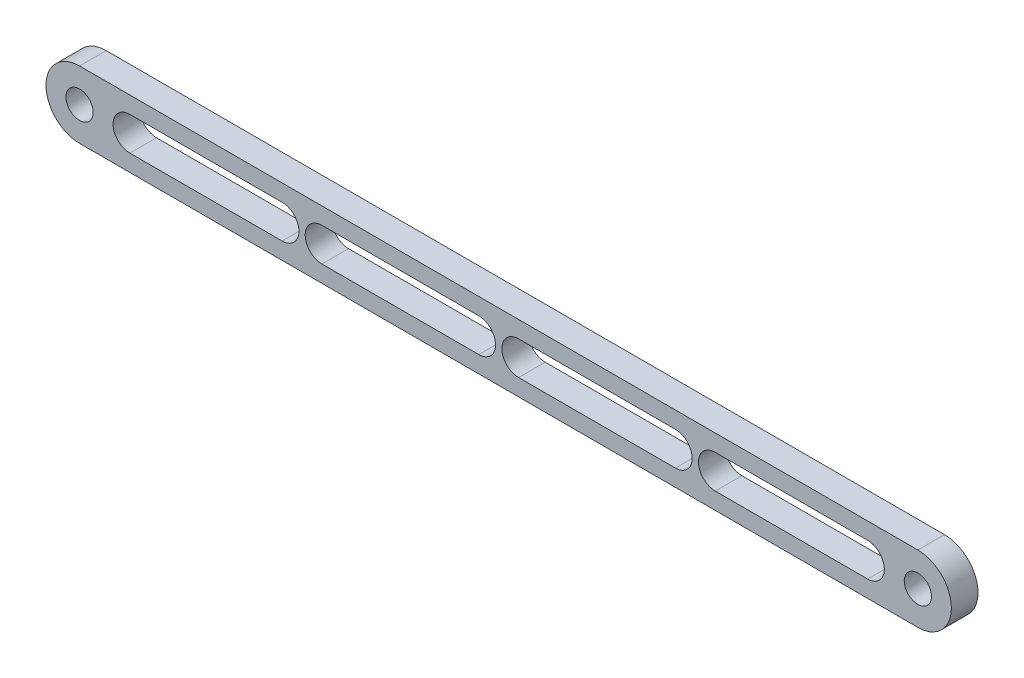
ISO-10303-21;
HEADER;
FILE_DESCRIPTION(('STEP AP214'),'2;1');
FILE_NAME('part.step','',(''),(''),'','','');
FILE_SCHEMA(('AUTOMOTIVE_DESIGN { 1 0 10303 214 1 1 1 1 }'));
ENDSEC;
DATA;
#1=APPLICATION_CONTEXT('core data for automotive mechanical design processes');
#2=APPLICATION_PROTOCOL_DEFINITION('international standard','automotive_design',2000,#1);
#3=PRODUCT_CONTEXT('',#1,'mechanical');
#4=PRODUCT('Part','Part','',(#3));
#5=PRODUCT_RELATED_PRODUCT_CATEGORY('part','',(#4));
#6=PRODUCT_DEFINITION_FORMATION('','',#4);
#7=PRODUCT_DEFINITION_CONTEXT('part definition',#1,'design');
#8=PRODUCT_DEFINITION('design','',#6,#7);
#9=PRODUCT_DEFINITION_SHAPE('','',#8);
#10=(LENGTH_UNIT() NAMED_UNIT(*) SI_UNIT(.MILLI.,.METRE.));
#11=(NAMED_UNIT(*) PLANE_ANGLE_UNIT() SI_UNIT($,.RADIAN.));
#12=(NAMED_UNIT(*) SI_UNIT($,.STERADIAN.) SOLID_ANGLE_UNIT());
#13=UNCERTAINTY_MEASURE_WITH_UNIT(LENGTH_MEASURE(1.E-05),#10,'distance_accuracy_value','');
#14=(GEOMETRIC_REPRESENTATION_CONTEXT(3) GLOBAL_UNCERTAINTY_ASSIGNED_CONTEXT((#13)) GLOBAL_UNIT_ASSIGNED_CONTEXT((#10,
#11,#12)) REPRESENTATION_CONTEXT('',''));
#15=CARTESIAN_POINT('',(0.,0.,0.));
#16=DIRECTION('',(0.,0.,1.));
#17=DIRECTION('',(1.,0.,0.));
#18=AXIS2_PLACEMENT_3D('',#15,#16,#17);
#19=CARTESIAN_POINT('',(200.,0.,0.));
#20=DIRECTION('',(0.,0.,1.));
#21=DIRECTION('',(1.,0.,0.));
#22=AXIS2_PLACEMENT_3D('',#19,#20,#21);
#23=CYLINDRICAL_SURFACE('',#22,8.);
#24=CARTESIAN_POINT('',(200.,0.,6.35));
#25=DIRECTION('',(0.,0.,1.));
#26=DIRECTION('',(1.,0.,0.));
#27=AXIS2_PLACEMENT_3D('',#24,#25,#26);
#28=CIRCLE('',#27,8.);
#29=CARTESIAN_POINT('',(200.,-8.,6.35));
#30=VERTEX_POINT('',#29);
#31=CARTESIAN_POINT('',(200.,8.,6.35));
#32=VERTEX_POINT('',#31);
#33=EDGE_CURVE('E312',#30,#32,#28,.T.);
#34=ORIENTED_EDGE('',*,*,#33,.F.);
#35=DIRECTION('',(0.,0.,1.));
#36=VECTOR('',#35,1.);
#37=CARTESIAN_POINT('',(200.,-8.,0.));
#38=LINE('',#37,#36);
#39=CARTESIAN_POINT('',(200.,-8.,0.));
#40=VERTEX_POINT('',#39);
#41=EDGE_CURVE('E11',#40,#30,#38,.T.);
#42=ORIENTED_EDGE('',*,*,#41,.F.);
#43=CARTESIAN_POINT('',(200.,0.,0.));
#44=DIRECTION('',(0.,0.,1.));
#45=DIRECTION('',(1.,0.,0.));
#46=AXIS2_PLACEMENT_3D('',#43,#44,#45);
#47=CIRCLE('',#46,8.);
#48=CARTESIAN_POINT('',(200.,8.,0.));
#49=VERTEX_POINT('',#48);
#50=EDGE_CURVE('E315',#40,#49,#47,.T.);
#51=ORIENTED_EDGE('',*,*,#50,.T.);
#52=DIRECTION('',(0.,0.,1.));
#53=VECTOR('',#52,1.);
#54=CARTESIAN_POINT('',(200.,8.,0.));
#55=LINE('',#54,#53);
#56=EDGE_CURVE('E36',#49,#32,#55,.T.);
#57=ORIENTED_EDGE('',*,*,#56,.T.);
#58=EDGE_LOOP('',(#34,#42,#51,#57));
#59=FACE_BOUND('',#58,.T.);
#60=ADVANCED_FACE('F33',(#59),#23,.T.);
#61=CARTESIAN_POINT('',(0.,-8.,0.));
#62=DIRECTION('',(0.,-1.,0.));
#63=DIRECTION('',(0.,0.,-1.));
#64=AXIS2_PLACEMENT_3D('',#61,#62,#63);
#65=PLANE('',#64);
#66=DIRECTION('',(1.,0.,0.));
#67=VECTOR('',#66,1.);
#68=CARTESIAN_POINT('',(0.,-8.,6.35));
#69=LINE('',#68,#67);
#70=CARTESIAN_POINT('',(0.,-8.,6.35));
#71=VERTEX_POINT('',#70);
#72=EDGE_CURVE('E319',#71,#30,#69,.T.);
#73=ORIENTED_EDGE('',*,*,#72,.F.);
#74=DIRECTION('',(0.,0.,1.));
#75=VECTOR('',#74,1.);
#76=CARTESIAN_POINT('',(0.,-8.,0.));
#77=LINE('',#76,#75);
#78=CARTESIAN_POINT('',(0.,-8.,0.));
#79=VERTEX_POINT('',#78);
#80=EDGE_CURVE('E41',#79,#71,#77,.T.);
#81=ORIENTED_EDGE('',*,*,#80,.F.);
#82=DIRECTION('',(1.,0.,0.));
#83=VECTOR('',#82,1.);
#84=CARTESIAN_POINT('',(0.,-8.,0.));
#85=LINE('',#84,#83);
#86=EDGE_CURVE('E325',#79,#40,#85,.T.);
#87=ORIENTED_EDGE('',*,*,#86,.T.);
#88=ORIENTED_EDGE('',*,*,#41,.T.);
#89=EDGE_LOOP('',(#73,#81,#87,#88));
#90=FACE_BOUND('',#89,.T.);
#91=ADVANCED_FACE('F351',(#90),#65,.T.);
#92=CARTESIAN_POINT('',(0.,0.,0.));
#93=DIRECTION('',(0.,0.,1.));
#94=DIRECTION('',(1.,0.,0.));
#95=AXIS2_PLACEMENT_3D('',#92,#93,#94);
#96=CYLINDRICAL_SURFACE('',#95,8.);
#97=CARTESIAN_POINT('',(0.,0.,6.35));
#98=DIRECTION('',(0.,0.,1.));
#99=DIRECTION('',(1.,0.,0.));
#100=AXIS2_PLACEMENT_3D('',#97,#98,#99);
#101=CIRCLE('',#100,8.);
#102=CARTESIAN_POINT('',(0.,8.,6.35));
#103=VERTEX_POINT('',#102);
#104=EDGE_CURVE('E333',#103,#71,#101,.T.);
#105=ORIENTED_EDGE('',*,*,#104,.F.);
#106=DIRECTION('',(0.,0.,1.));
#107=VECTOR('',#106,1.);
#108=CARTESIAN_POINT('',(0.,8.,0.));
#109=LINE('',#108,#107);
#110=CARTESIAN_POINT('',(0.,8.,0.));
#111=VERTEX_POINT('',#110);
#112=EDGE_CURVE('E338',#111,#103,#109,.T.);
#113=ORIENTED_EDGE('',*,*,#112,.F.);
#114=CARTESIAN_POINT('',(0.,0.,0.));
#115=DIRECTION('',(0.,0.,1.));
#116=DIRECTION('',(1.,0.,0.));
#117=AXIS2_PLACEMENT_3D('',#114,#115,#116);
#118=CIRCLE('',#117,8.);
#119=EDGE_CURVE('E322',#111,#79,#118,.T.);
#120=ORIENTED_EDGE('',*,*,#119,.T.);
#121=ORIENTED_EDGE('',*,*,#80,.T.);
#122=EDGE_LOOP('',(#105,#113,#120,#121));
#123=FACE_BOUND('',#122,.T.);
#124=ADVANCED_FACE('F356',(#123),#96,.T.);
#125=CARTESIAN_POINT('',(200.,8.,0.));
#126=DIRECTION('',(0.,1.,0.));
#127=DIRECTION('',(0.,0.,1.));
#128=AXIS2_PLACEMENT_3D('',#125,#126,#127);
#129=PLANE('',#128);
#130=DIRECTION('',(-1.,0.,0.));
#131=VECTOR('',#130,1.);
#132=CARTESIAN_POINT('',(200.,8.,6.35));
#133=LINE('',#132,#131);
#134=EDGE_CURVE('E330',#32,#103,#133,.T.);
#135=ORIENTED_EDGE('',*,*,#134,.F.);
#136=ORIENTED_EDGE('',*,*,#56,.F.);
#137=DIRECTION('',(-1.,0.,0.));
#138=VECTOR('',#137,1.);
#139=CARTESIAN_POINT('',(200.,8.,0.));
#140=LINE('',#139,#138);
#141=EDGE_CURVE('E318',#49,#111,#140,.T.);
#142=ORIENTED_EDGE('',*,*,#141,.T.);
#143=ORIENTED_EDGE('',*,*,#112,.T.);
#144=EDGE_LOOP('',(#135,#136,#142,#143));
#145=FACE_BOUND('',#144,.T.);
#146=ADVANCED_FACE('F346',(#145),#129,.T.);
#147=CARTESIAN_POINT('',(200.,0.,0.));
#148=DIRECTION('',(0.,0.,1.));
#149=DIRECTION('',(1.,0.,0.));
#150=AXIS2_PLACEMENT_3D('',#147,#148,#149);
#151=PLANE('',#150);
#152=DIRECTION('',(1.,0.,0.));
#153=VECTOR('',#152,1.);
#154=CARTESIAN_POINT('',(188.,-4.,0.));
#155=LINE('',#154,#153);
#156=CARTESIAN_POINT('',(151.660898385,-3.99999999999999,0.));
#157=VERTEX_POINT('',#156);
#158=CARTESIAN_POINT('',(188.,-4.,0.));
#159=VERTEX_POINT('',#158);
#160=EDGE_CURVE('E178',#157,#159,#155,.T.);
#161=ORIENTED_EDGE('',*,*,#160,.T.);
#162=CARTESIAN_POINT('',(188.,0.,0.));
#163=DIRECTION('',(0.,0.,1.));
#164=DIRECTION('',(-1.,0.,0.));
#165=AXIS2_PLACEMENT_3D('',#162,#163,#164);
#166=CIRCLE('',#165,4.);
#167=CARTESIAN_POINT('',(188.,4.,0.));
#168=VERTEX_POINT('',#167);
#169=EDGE_CURVE('E172',#159,#168,#166,.T.);
#170=ORIENTED_EDGE('',*,*,#169,.T.);
#171=DIRECTION('',(-1.,0.,0.));
#172=VECTOR('',#171,1.);
#173=CARTESIAN_POINT('',(151.660898385,4.,0.));
#174=LINE('',#173,#172);
#175=CARTESIAN_POINT('',(151.660898385,4.,0.));
#176=VERTEX_POINT('',#175);
#177=EDGE_CURVE('E181',#168,#176,#174,.T.);
#178=ORIENTED_EDGE('',*,*,#177,.T.);
#179=CARTESIAN_POINT('',(151.660898385,0.,0.));
#180=DIRECTION('',(0.,0.,1.));
#181=DIRECTION('',(-1.,0.,0.));
#182=AXIS2_PLACEMENT_3D('',#179,#180,#181);
#183=CIRCLE('',#182,3.99999999999999);
#184=EDGE_CURVE('E49',#176,#157,#183,.T.);
#185=ORIENTED_EDGE('',*,*,#184,.T.);
#186=EDGE_LOOP('',(#161,#170,#178,#185));
#187=FACE_BOUND('',#186,.T.);
#188=DIRECTION('',(-1.,0.,0.));
#189=VECTOR('',#188,1.);
#190=CARTESIAN_POINT('',(57.839101615,4.,0.));
#191=LINE('',#190,#189);
#192=CARTESIAN_POINT('',(95.25,4.,0.));
#193=VERTEX_POINT('',#192);
#194=CARTESIAN_POINT('',(57.839101615,4.,0.));
#195=VERTEX_POINT('',#194);
#196=EDGE_CURVE('E217',#193,#195,#191,.T.);
#197=ORIENTED_EDGE('',*,*,#196,.T.);
#198=CARTESIAN_POINT('',(57.839101615,0.,0.));
#199=DIRECTION('',(0.,0.,1.));
#200=DIRECTION('',(-1.,0.,0.));
#201=AXIS2_PLACEMENT_3D('',#198,#199,#200);
#202=CIRCLE('',#201,4.);
#203=CARTESIAN_POINT('',(57.839101615,-4.,0.));
#204=VERTEX_POINT('',#203);
#205=EDGE_CURVE('E207',#195,#204,#202,.T.);
#206=ORIENTED_EDGE('',*,*,#205,.T.);
#207=DIRECTION('',(1.,0.,0.));
#208=VECTOR('',#207,1.);
#209=CARTESIAN_POINT('',(95.25,-4.,0.));
#210=LINE('',#209,#208);
#211=CARTESIAN_POINT('',(95.25,-4.,0.));
#212=VERTEX_POINT('',#211);
#213=EDGE_CURVE('E210',#204,#212,#210,.T.);
#214=ORIENTED_EDGE('',*,*,#213,.T.);
#215=CARTESIAN_POINT('',(95.25,0.,0.));
#216=DIRECTION('',(0.,0.,1.));
#217=DIRECTION('',(-1.,0.,0.));
#218=AXIS2_PLACEMENT_3D('',#215,#216,#217);
#219=CIRCLE('',#218,4.);
#220=EDGE_CURVE('E214',#212,#193,#219,.T.);
#221=ORIENTED_EDGE('',*,*,#220,.T.);
#222=EDGE_LOOP('',(#197,#206,#214,#221));
#223=FACE_BOUND('',#222,.T.);
#224=DIRECTION('',(-1.,0.,0.));
#225=VECTOR('',#224,1.);
#226=CARTESIAN_POINT('',(12.,4.,0.));
#227=LINE('',#226,#225);
#228=CARTESIAN_POINT('',(48.339101615,4.,0.));
#229=VERTEX_POINT('',#228);
#230=CARTESIAN_POINT('',(12.,4.,0.));
#231=VERTEX_POINT('',#230);
#232=EDGE_CURVE('E249',#229,#231,#227,.T.);
#233=ORIENTED_EDGE('',*,*,#232,.T.);
#234=CARTESIAN_POINT('',(12.,0.,0.));
#235=DIRECTION('',(0.,0.,1.));
#236=DIRECTION('',(-1.,0.,0.));
#237=AXIS2_PLACEMENT_3D('',#234,#235,#236);
#238=CIRCLE('',#237,4.);
#239=CARTESIAN_POINT('',(12.,-4.,0.));
#240=VERTEX_POINT('',#239);
#241=EDGE_CURVE('E239',#231,#240,#238,.T.);
#242=ORIENTED_EDGE('',*,*,#241,.T.);
#243=DIRECTION('',(1.,0.,0.));
#244=VECTOR('',#243,1.);
#245=CARTESIAN_POINT('',(48.339101615,-3.99999999999999,0.));
#246=LINE('',#245,#244);
#247=CARTESIAN_POINT('',(48.339101615,-3.99999999999999,0.));
#248=VERTEX_POINT('',#247);
#249=EDGE_CURVE('E242',#240,#248,#246,.T.);
#250=ORIENTED_EDGE('',*,*,#249,.T.);
#251=CARTESIAN_POINT('',(48.339101615,0.,0.));
#252=DIRECTION('',(0.,0.,1.));
#253=DIRECTION('',(-1.,0.,0.));
#254=AXIS2_PLACEMENT_3D('',#251,#252,#253);
#255=CIRCLE('',#254,4.);
#256=EDGE_CURVE('E246',#248,#229,#255,.T.);
#257=ORIENTED_EDGE('',*,*,#256,.T.);
#258=EDGE_LOOP('',(#233,#242,#250,#257));
#259=FACE_BOUND('',#258,.T.);
#260=DIRECTION('',(-1.,0.,0.));
#261=VECTOR('',#260,1.);
#262=CARTESIAN_POINT('',(104.75,4.,0.));
#263=LINE('',#262,#261);
#264=CARTESIAN_POINT('',(142.160898385,4.,0.));
#265=VERTEX_POINT('',#264);
#266=CARTESIAN_POINT('',(104.75,4.,0.));
#267=VERTEX_POINT('',#266);
#268=EDGE_CURVE('E281',#265,#267,#263,.T.);
#269=ORIENTED_EDGE('',*,*,#268,.T.);
#270=CARTESIAN_POINT('',(104.75,0.,0.));
#271=DIRECTION('',(0.,0.,1.));
#272=DIRECTION('',(-1.,0.,0.));
#273=AXIS2_PLACEMENT_3D('',#270,#271,#272);
#274=CIRCLE('',#273,3.99999999999999);
#275=CARTESIAN_POINT('',(104.75,-3.99999999999999,0.));
#276=VERTEX_POINT('',#275);
#277=EDGE_CURVE('E271',#267,#276,#274,.T.);
#278=ORIENTED_EDGE('',*,*,#277,.T.);
#279=DIRECTION('',(1.,0.,0.));
#280=VECTOR('',#279,1.);
#281=CARTESIAN_POINT('',(142.160898385,-3.99999999999998,0.));
#282=LINE('',#281,#280);
#283=CARTESIAN_POINT('',(142.160898385,-3.99999999999998,0.));
#284=VERTEX_POINT('',#283);
#285=EDGE_CURVE('E274',#276,#284,#282,.T.);
#286=ORIENTED_EDGE('',*,*,#285,.T.);
#287=CARTESIAN_POINT('',(142.160898385,0.,0.));
#288=DIRECTION('',(0.,0.,1.));
#289=DIRECTION('',(-1.,0.,0.));
#290=AXIS2_PLACEMENT_3D('',#287,#288,#289);
#291=CIRCLE('',#290,3.99999999999999);
#292=EDGE_CURVE('E278',#284,#265,#291,.T.);
#293=ORIENTED_EDGE('',*,*,#292,.T.);
#294=EDGE_LOOP('',(#269,#278,#286,#293));
#295=FACE_BOUND('',#294,.T.);
#296=CARTESIAN_POINT('',(0.,0.,0.));
#297=DIRECTION('',(0.,0.,1.));
#298=DIRECTION('',(-1.,0.,0.));
#299=AXIS2_PLACEMENT_3D('',#296,#297,#298);
#300=CIRCLE('',#299,3.25);
#301=CARTESIAN_POINT('',(-3.25,0.,0.));
#302=VERTEX_POINT('',#301);
#303=EDGE_CURVE('E303',#302,#302,#300,.T.);
#304=ORIENTED_EDGE('',*,*,#303,.T.);
#305=EDGE_LOOP('',(#304));
#306=FACE_BOUND('',#305,.T.);
#307=CARTESIAN_POINT('',(200.,0.,0.));
#308=DIRECTION('',(0.,0.,1.));
#309=DIRECTION('',(-1.,0.,0.));
#310=AXIS2_PLACEMENT_3D('',#307,#308,#309);
#311=CIRCLE('',#310,3.25);
#312=CARTESIAN_POINT('',(196.75,0.,0.));
#313=VERTEX_POINT('',#312);
#314=EDGE_CURVE('E309',#313,#313,#311,.T.);
#315=ORIENTED_EDGE('',*,*,#314,.T.);
#316=EDGE_LOOP('',(#315));
#317=FACE_BOUND('',#316,.T.);
#318=ORIENTED_EDGE('',*,*,#50,.F.);
#319=ORIENTED_EDGE('',*,*,#86,.F.);
#320=ORIENTED_EDGE('',*,*,#119,.F.);
#321=ORIENTED_EDGE('',*,*,#141,.F.);
#322=EDGE_LOOP('',(#318,#319,#320,#321));
#323=FACE_BOUND('',#322,.T.);
#324=ADVANCED_FACE('F185',(#187,#223,#259,#295,#306,#317,#323),#151,.F.);
#325=CARTESIAN_POINT('',(200.,0.,6.35));
#326=DIRECTION('',(0.,0.,1.));
#327=DIRECTION('',(1.,0.,0.));
#328=AXIS2_PLACEMENT_3D('',#325,#326,#327);
#329=PLANE('',#328);
#330=CARTESIAN_POINT('',(188.,0.,6.35));
#331=DIRECTION('',(0.,0.,1.));
#332=DIRECTION('',(-1.,0.,0.));
#333=AXIS2_PLACEMENT_3D('',#330,#331,#332);
#334=CIRCLE('',#333,4.);
#335=CARTESIAN_POINT('',(188.,-4.,6.35));
#336=VERTEX_POINT('',#335);
#337=CARTESIAN_POINT('',(188.,4.,6.35));
#338=VERTEX_POINT('',#337);
#339=EDGE_CURVE('E57',#336,#338,#334,.T.);
#340=ORIENTED_EDGE('',*,*,#339,.F.);
#341=DIRECTION('',(1.,0.,0.));
#342=VECTOR('',#341,1.);
#343=CARTESIAN_POINT('',(188.,-4.,6.35));
#344=LINE('',#343,#342);
#345=CARTESIAN_POINT('',(151.660898385,-3.99999999999999,6.35));
#346=VERTEX_POINT('',#345);
#347=EDGE_CURVE('E188',#346,#336,#344,.T.);
#348=ORIENTED_EDGE('',*,*,#347,.F.);
#349=CARTESIAN_POINT('',(151.660898385,0.,6.35));
#350=DIRECTION('',(0.,0.,1.));
#351=DIRECTION('',(-1.,0.,0.));
#352=AXIS2_PLACEMENT_3D('',#349,#350,#351);
#353=CIRCLE('',#352,3.99999999999999);
#354=CARTESIAN_POINT('',(151.660898385,4.,6.35));
#355=VERTEX_POINT('',#354);
#356=EDGE_CURVE('E191',#355,#346,#353,.T.);
#357=ORIENTED_EDGE('',*,*,#356,.F.);
#358=DIRECTION('',(-1.,0.,0.));
#359=VECTOR('',#358,1.);
#360=CARTESIAN_POINT('',(151.660898385,4.,6.35));
#361=LINE('',#360,#359);
#362=EDGE_CURVE('E197',#338,#355,#361,.T.);
#363=ORIENTED_EDGE('',*,*,#362,.F.);
#364=EDGE_LOOP('',(#340,#348,#357,#363));
#365=FACE_BOUND('',#364,.T.);
#366=CARTESIAN_POINT('',(57.839101615,0.,6.35));
#367=DIRECTION('',(0.,0.,1.));
#368=DIRECTION('',(-1.,0.,0.));
#369=AXIS2_PLACEMENT_3D('',#366,#367,#368);
#370=CIRCLE('',#369,4.);
#371=CARTESIAN_POINT('',(57.839101615,4.,6.35));
#372=VERTEX_POINT('',#371);
#373=CARTESIAN_POINT('',(57.839101615,-4.,6.35));
#374=VERTEX_POINT('',#373);
#375=EDGE_CURVE('E203',#372,#374,#370,.T.);
#376=ORIENTED_EDGE('',*,*,#375,.F.);
#377=DIRECTION('',(-1.,0.,0.));
#378=VECTOR('',#377,1.);
#379=CARTESIAN_POINT('',(57.839101615,4.,6.35));
#380=LINE('',#379,#378);
#381=CARTESIAN_POINT('',(95.25,4.,6.35));
#382=VERTEX_POINT('',#381);
#383=EDGE_CURVE('E211',#382,#372,#380,.T.);
#384=ORIENTED_EDGE('',*,*,#383,.F.);
#385=CARTESIAN_POINT('',(95.25,0.,6.35));
#386=DIRECTION('',(0.,0.,1.));
#387=DIRECTION('',(-1.,0.,0.));
#388=AXIS2_PLACEMENT_3D('',#385,#386,#387);
#389=CIRCLE('',#388,4.);
#390=CARTESIAN_POINT('',(95.25,-4.,6.35));
#391=VERTEX_POINT('',#390);
#392=EDGE_CURVE('E225',#391,#382,#389,.T.);
#393=ORIENTED_EDGE('',*,*,#392,.F.);
#394=DIRECTION('',(1.,0.,0.));
#395=VECTOR('',#394,1.);
#396=CARTESIAN_POINT('',(95.25,-4.,6.35));
#397=LINE('',#396,#395);
#398=EDGE_CURVE('E222',#374,#391,#397,.T.);
#399=ORIENTED_EDGE('',*,*,#398,.F.);
#400=EDGE_LOOP('',(#376,#384,#393,#399));
#401=FACE_BOUND('',#400,.T.);
#402=CARTESIAN_POINT('',(12.,0.,6.35));
#403=DIRECTION('',(0.,0.,1.));
#404=DIRECTION('',(-1.,0.,0.));
#405=AXIS2_PLACEMENT_3D('',#402,#403,#404);
#406=CIRCLE('',#405,4.);
#407=CARTESIAN_POINT('',(12.,4.,6.35));
#408=VERTEX_POINT('',#407);
#409=CARTESIAN_POINT('',(12.,-4.,6.35));
#410=VERTEX_POINT('',#409);
#411=EDGE_CURVE('E232',#408,#410,#406,.T.);
#412=ORIENTED_EDGE('',*,*,#411,.F.);
#413=DIRECTION('',(-1.,0.,0.));
#414=VECTOR('',#413,1.);
#415=CARTESIAN_POINT('',(12.,4.,6.35));
#416=LINE('',#415,#414);
#417=CARTESIAN_POINT('',(48.339101615,4.,6.35));
#418=VERTEX_POINT('',#417);
#419=EDGE_CURVE('E243',#418,#408,#416,.T.);
#420=ORIENTED_EDGE('',*,*,#419,.F.);
#421=CARTESIAN_POINT('',(48.339101615,0.,6.35));
#422=DIRECTION('',(0.,0.,1.));
#423=DIRECTION('',(-1.,0.,0.));
#424=AXIS2_PLACEMENT_3D('',#421,#422,#423);
#425=CIRCLE('',#424,4.);
#426=CARTESIAN_POINT('',(48.339101615,-4.,6.35));
#427=VERTEX_POINT('',#426);
#428=EDGE_CURVE('E257',#427,#418,#425,.T.);
#429=ORIENTED_EDGE('',*,*,#428,.F.);
#430=DIRECTION('',(1.,0.,0.));
#431=VECTOR('',#430,1.);
#432=CARTESIAN_POINT('',(48.339101615,-3.99999999999999,6.35));
#433=LINE('',#432,#431);
#434=EDGE_CURVE('E254',#410,#427,#433,.T.);
#435=ORIENTED_EDGE('',*,*,#434,.F.);
#436=EDGE_LOOP('',(#412,#420,#429,#435));
#437=FACE_BOUND('',#436,.T.);
#438=CARTESIAN_POINT('',(104.75,0.,6.35));
#439=DIRECTION('',(0.,0.,1.));
#440=DIRECTION('',(-1.,0.,0.));
#441=AXIS2_PLACEMENT_3D('',#438,#439,#440);
#442=CIRCLE('',#441,3.99999999999999);
#443=CARTESIAN_POINT('',(104.75,4.,6.35));
#444=VERTEX_POINT('',#443);
#445=CARTESIAN_POINT('',(104.75,-3.99999999999999,6.35));
#446=VERTEX_POINT('',#445);
#447=EDGE_CURVE('E264',#444,#446,#442,.T.);
#448=ORIENTED_EDGE('',*,*,#447,.F.);
#449=DIRECTION('',(-1.,0.,0.));
#450=VECTOR('',#449,1.);
#451=CARTESIAN_POINT('',(104.75,4.,6.35));
#452=LINE('',#451,#450);
#453=CARTESIAN_POINT('',(142.160898385,4.,6.35));
#454=VERTEX_POINT('',#453);
#455=EDGE_CURVE('E275',#454,#444,#452,.T.);
#456=ORIENTED_EDGE('',*,*,#455,.F.);
#457=CARTESIAN_POINT('',(142.160898385,0.,6.35));
#458=DIRECTION('',(0.,0.,1.));
#459=DIRECTION('',(-1.,0.,0.));
#460=AXIS2_PLACEMENT_3D('',#457,#458,#459);
#461=CIRCLE('',#460,3.99999999999999);
#462=CARTESIAN_POINT('',(142.160898385,-3.99999999999999,6.35));
#463=VERTEX_POINT('',#462);
#464=EDGE_CURVE('E289',#463,#454,#461,.T.);
#465=ORIENTED_EDGE('',*,*,#464,.F.);
#466=DIRECTION('',(1.,0.,0.));
#467=VECTOR('',#466,1.);
#468=CARTESIAN_POINT('',(142.160898385,-3.99999999999998,6.35));
#469=LINE('',#468,#467);
#470=EDGE_CURVE('E286',#446,#463,#469,.T.);
#471=ORIENTED_EDGE('',*,*,#470,.F.);
#472=EDGE_LOOP('',(#448,#456,#465,#471));
#473=FACE_BOUND('',#472,.T.);
#474=CARTESIAN_POINT('',(0.,0.,6.35));
#475=DIRECTION('',(0.,0.,1.));
#476=DIRECTION('',(-1.,0.,0.));
#477=AXIS2_PLACEMENT_3D('',#474,#475,#476);
#478=CIRCLE('',#477,3.25);
#479=CARTESIAN_POINT('',(-3.25,0.,6.35));
#480=VERTEX_POINT('',#479);
#481=EDGE_CURVE('E296',#480,#480,#478,.T.);
#482=ORIENTED_EDGE('',*,*,#481,.F.);
#483=EDGE_LOOP('',(#482));
#484=FACE_BOUND('',#483,.T.);
#485=CARTESIAN_POINT('',(200.,0.,6.35));
#486=DIRECTION('',(0.,0.,1.));
#487=DIRECTION('',(-1.,0.,0.));
#488=AXIS2_PLACEMENT_3D('',#485,#486,#487);
#489=CIRCLE('',#488,3.25);
#490=CARTESIAN_POINT('',(196.75,0.,6.35));
#491=VERTEX_POINT('',#490);
#492=EDGE_CURVE('E306',#491,#491,#489,.T.);
#493=ORIENTED_EDGE('',*,*,#492,.F.);
#494=EDGE_LOOP('',(#493));
#495=FACE_BOUND('',#494,.T.);
#496=ORIENTED_EDGE('',*,*,#33,.T.);
#497=ORIENTED_EDGE('',*,*,#134,.T.);
#498=ORIENTED_EDGE('',*,*,#104,.T.);
#499=ORIENTED_EDGE('',*,*,#72,.T.);
#500=EDGE_LOOP('',(#496,#497,#498,#499));
#501=FACE_BOUND('',#500,.T.);
#502=ADVANCED_FACE('F348',(#365,#401,#437,#473,#484,#495,#501),#329,.T.);
#503=CARTESIAN_POINT('',(200.,0.,0.));
#504=DIRECTION('',(0.,0.,1.));
#505=DIRECTION('',(1.,0.,0.));
#506=AXIS2_PLACEMENT_3D('',#503,#504,#505);
#507=CYLINDRICAL_SURFACE('',#506,3.25);
#508=ORIENTED_EDGE('',*,*,#314,.F.);
#509=EDGE_LOOP('',(#508));
#510=FACE_BOUND('',#509,.T.);
#511=ORIENTED_EDGE('',*,*,#492,.T.);
#512=EDGE_LOOP('',(#511));
#513=FACE_BOUND('',#512,.T.);
#514=ADVANCED_FACE('F398',(#510,#513),#507,.F.);
#515=CARTESIAN_POINT('',(0.,0.,0.));
#516=DIRECTION('',(0.,0.,1.));
#517=DIRECTION('',(1.,0.,0.));
#518=AXIS2_PLACEMENT_3D('',#515,#516,#517);
#519=CYLINDRICAL_SURFACE('',#518,3.25);
#520=ORIENTED_EDGE('',*,*,#303,.F.);
#521=EDGE_LOOP('',(#520));
#522=FACE_BOUND('',#521,.T.);
#523=ORIENTED_EDGE('',*,*,#481,.T.);
#524=EDGE_LOOP('',(#523));
#525=FACE_BOUND('',#524,.T.);
#526=ADVANCED_FACE('F408',(#522,#525),#519,.F.);
#527=CARTESIAN_POINT('',(104.75,0.,0.));
#528=DIRECTION('',(0.,0.,1.));
#529=DIRECTION('',(1.,0.,0.));
#530=AXIS2_PLACEMENT_3D('',#527,#528,#529);
#531=CYLINDRICAL_SURFACE('',#530,3.99999999999999);
#532=ORIENTED_EDGE('',*,*,#447,.T.);
#533=DIRECTION('',(0.,0.,1.));
#534=VECTOR('',#533,1.);
#535=CARTESIAN_POINT('',(104.75,-3.99999999999999,0.));
#536=LINE('',#535,#534);
#537=EDGE_CURVE('E284',#276,#446,#536,.T.);
#538=ORIENTED_EDGE('',*,*,#537,.F.);
#539=ORIENTED_EDGE('',*,*,#277,.F.);
#540=DIRECTION('',(0.,0.,1.));
#541=VECTOR('',#540,1.);
#542=CARTESIAN_POINT('',(104.75,4.,0.));
#543=LINE('',#542,#541);
#544=EDGE_CURVE('E294',#267,#444,#543,.T.);
#545=ORIENTED_EDGE('',*,*,#544,.T.);
#546=EDGE_LOOP('',(#532,#538,#539,#545));
#547=FACE_BOUND('',#546,.T.);
#548=ADVANCED_FACE('F418',(#547),#531,.F.);
#549=CARTESIAN_POINT('',(104.75,4.,0.));
#550=DIRECTION('',(0.,1.,0.));
#551=DIRECTION('',(0.,0.,1.));
#552=AXIS2_PLACEMENT_3D('',#549,#550,#551);
#553=PLANE('',#552);
#554=ORIENTED_EDGE('',*,*,#455,.T.);
#555=ORIENTED_EDGE('',*,*,#544,.F.);
#556=ORIENTED_EDGE('',*,*,#268,.F.);
#557=DIRECTION('',(0.,0.,1.));
#558=VECTOR('',#557,1.);
#559=CARTESIAN_POINT('',(142.160898385,4.,0.));
#560=LINE('',#559,#558);
#561=EDGE_CURVE('E297',#265,#454,#560,.T.);
#562=ORIENTED_EDGE('',*,*,#561,.T.);
#563=EDGE_LOOP('',(#554,#555,#556,#562));
#564=FACE_BOUND('',#563,.T.);
#565=ADVANCED_FACE('F428',(#564),#553,.F.);
#566=CARTESIAN_POINT('',(142.160898385,0.,0.));
#567=DIRECTION('',(0.,0.,1.));
#568=DIRECTION('',(1.,0.,0.));
#569=AXIS2_PLACEMENT_3D('',#566,#567,#568);
#570=CYLINDRICAL_SURFACE('',#569,3.99999999999999);
#571=ORIENTED_EDGE('',*,*,#464,.T.);
#572=ORIENTED_EDGE('',*,*,#561,.F.);
#573=ORIENTED_EDGE('',*,*,#292,.F.);
#574=DIRECTION('',(0.,0.,1.));
#575=VECTOR('',#574,1.);
#576=CARTESIAN_POINT('',(142.160898385,-3.99999999999999,0.));
#577=LINE('',#576,#575);
#578=EDGE_CURVE('E299',#284,#463,#577,.T.);
#579=ORIENTED_EDGE('',*,*,#578,.T.);
#580=EDGE_LOOP('',(#571,#572,#573,#579));
#581=FACE_BOUND('',#580,.T.);
#582=ADVANCED_FACE('F438',(#581),#570,.F.);
#583=CARTESIAN_POINT('',(142.160898385,-3.99999999999998,0.));
#584=DIRECTION('',(0.,-1.,0.));
#585=DIRECTION('',(1.,0.,0.));
#586=AXIS2_PLACEMENT_3D('',#583,#584,#585);
#587=PLANE('',#586);
#588=ORIENTED_EDGE('',*,*,#470,.T.);
#589=ORIENTED_EDGE('',*,*,#578,.F.);
#590=ORIENTED_EDGE('',*,*,#285,.F.);
#591=ORIENTED_EDGE('',*,*,#537,.T.);
#592=EDGE_LOOP('',(#588,#589,#590,#591));
#593=FACE_BOUND('',#592,.T.);
#594=ADVANCED_FACE('F448',(#593),#587,.F.);
#595=CARTESIAN_POINT('',(12.,0.,0.));
#596=DIRECTION('',(0.,0.,1.));
#597=DIRECTION('',(1.,0.,0.));
#598=AXIS2_PLACEMENT_3D('',#595,#596,#597);
#599=CYLINDRICAL_SURFACE('',#598,4.);
#600=ORIENTED_EDGE('',*,*,#411,.T.);
#601=DIRECTION('',(0.,0.,1.));
#602=VECTOR('',#601,1.);
#603=CARTESIAN_POINT('',(12.,-4.,0.));
#604=LINE('',#603,#602);
#605=EDGE_CURVE('E252',#240,#410,#604,.T.);
#606=ORIENTED_EDGE('',*,*,#605,.F.);
#607=ORIENTED_EDGE('',*,*,#241,.F.);
#608=DIRECTION('',(0.,0.,1.));
#609=VECTOR('',#608,1.);
#610=CARTESIAN_POINT('',(12.,4.,0.));
#611=LINE('',#610,#609);
#612=EDGE_CURVE('E262',#231,#408,#611,.T.);
#613=ORIENTED_EDGE('',*,*,#612,.T.);
#614=EDGE_LOOP('',(#600,#606,#607,#613));
#615=FACE_BOUND('',#614,.T.);
#616=ADVANCED_FACE('F458',(#615),#599,.F.);
#617=CARTESIAN_POINT('',(12.,4.,0.));
#618=DIRECTION('',(0.,1.,0.));
#619=DIRECTION('',(0.,0.,1.));
#620=AXIS2_PLACEMENT_3D('',#617,#618,#619);
#621=PLANE('',#620);
#622=ORIENTED_EDGE('',*,*,#419,.T.);
#623=ORIENTED_EDGE('',*,*,#612,.F.);
#624=ORIENTED_EDGE('',*,*,#232,.F.);
#625=DIRECTION('',(0.,0.,1.));
#626=VECTOR('',#625,1.);
#627=CARTESIAN_POINT('',(48.339101615,4.,0.));
#628=LINE('',#627,#626);
#629=EDGE_CURVE('E265',#229,#418,#628,.T.);
#630=ORIENTED_EDGE('',*,*,#629,.T.);
#631=EDGE_LOOP('',(#622,#623,#624,#630));
#632=FACE_BOUND('',#631,.T.);
#633=ADVANCED_FACE('F468',(#632),#621,.F.);
#634=CARTESIAN_POINT('',(48.339101615,0.,0.));
#635=DIRECTION('',(0.,0.,1.));
#636=DIRECTION('',(1.,0.,0.));
#637=AXIS2_PLACEMENT_3D('',#634,#635,#636);
#638=CYLINDRICAL_SURFACE('',#637,4.);
#639=ORIENTED_EDGE('',*,*,#428,.T.);
#640=ORIENTED_EDGE('',*,*,#629,.F.);
#641=ORIENTED_EDGE('',*,*,#256,.F.);
#642=DIRECTION('',(0.,0.,1.));
#643=VECTOR('',#642,1.);
#644=CARTESIAN_POINT('',(48.339101615,-4.,0.));
#645=LINE('',#644,#643);
#646=EDGE_CURVE('E267',#248,#427,#645,.T.);
#647=ORIENTED_EDGE('',*,*,#646,.T.);
#648=EDGE_LOOP('',(#639,#640,#641,#647));
#649=FACE_BOUND('',#648,.T.);
#650=ADVANCED_FACE('F478',(#649),#638,.F.);
#651=CARTESIAN_POINT('',(48.339101615,-3.99999999999999,0.));
#652=DIRECTION('',(0.,-1.,0.));
#653=DIRECTION('',(1.,0.,0.));
#654=AXIS2_PLACEMENT_3D('',#651,#652,#653);
#655=PLANE('',#654);
#656=ORIENTED_EDGE('',*,*,#434,.T.);
#657=ORIENTED_EDGE('',*,*,#646,.F.);
#658=ORIENTED_EDGE('',*,*,#249,.F.);
#659=ORIENTED_EDGE('',*,*,#605,.T.);
#660=EDGE_LOOP('',(#656,#657,#658,#659));
#661=FACE_BOUND('',#660,.T.);
#662=ADVANCED_FACE('F488',(#661),#655,.F.);
#663=CARTESIAN_POINT('',(57.839101615,0.,0.));
#664=DIRECTION('',(0.,0.,1.));
#665=DIRECTION('',(1.,0.,0.));
#666=AXIS2_PLACEMENT_3D('',#663,#664,#665);
#667=CYLINDRICAL_SURFACE('',#666,4.);
#668=ORIENTED_EDGE('',*,*,#375,.T.);
#669=DIRECTION('',(0.,0.,1.));
#670=VECTOR('',#669,1.);
#671=CARTESIAN_POINT('',(57.839101615,-4.,0.));
#672=LINE('',#671,#670);
#673=EDGE_CURVE('E220',#204,#374,#672,.T.);
#674=ORIENTED_EDGE('',*,*,#673,.F.);
#675=ORIENTED_EDGE('',*,*,#205,.F.);
#676=DIRECTION('',(0.,0.,1.));
#677=VECTOR('',#676,1.);
#678=CARTESIAN_POINT('',(57.839101615,4.,0.));
#679=LINE('',#678,#677);
#680=EDGE_CURVE('E230',#195,#372,#679,.T.);
#681=ORIENTED_EDGE('',*,*,#680,.T.);
#682=EDGE_LOOP('',(#668,#674,#675,#681));
#683=FACE_BOUND('',#682,.T.);
#684=ADVANCED_FACE('F498',(#683),#667,.F.);
#685=CARTESIAN_POINT('',(57.839101615,4.,0.));
#686=DIRECTION('',(0.,1.,0.));
#687=DIRECTION('',(-1.,0.,0.));
#688=AXIS2_PLACEMENT_3D('',#685,#686,#687);
#689=PLANE('',#688);
#690=ORIENTED_EDGE('',*,*,#383,.T.);
#691=ORIENTED_EDGE('',*,*,#680,.F.);
#692=ORIENTED_EDGE('',*,*,#196,.F.);
#693=DIRECTION('',(0.,0.,1.));
#694=VECTOR('',#693,1.);
#695=CARTESIAN_POINT('',(95.25,4.,0.));
#696=LINE('',#695,#694);
#697=EDGE_CURVE('E233',#193,#382,#696,.T.);
#698=ORIENTED_EDGE('',*,*,#697,.T.);
#699=EDGE_LOOP('',(#690,#691,#692,#698));
#700=FACE_BOUND('',#699,.T.);
#701=ADVANCED_FACE('F508',(#700),#689,.F.);
#702=CARTESIAN_POINT('',(95.25,0.,0.));
#703=DIRECTION('',(0.,0.,1.));
#704=DIRECTION('',(1.,0.,0.));
#705=AXIS2_PLACEMENT_3D('',#702,#703,#704);
#706=CYLINDRICAL_SURFACE('',#705,4.);
#707=ORIENTED_EDGE('',*,*,#392,.T.);
#708=ORIENTED_EDGE('',*,*,#697,.F.);
#709=ORIENTED_EDGE('',*,*,#220,.F.);
#710=DIRECTION('',(0.,0.,1.));
#711=VECTOR('',#710,1.);
#712=CARTESIAN_POINT('',(95.25,-4.,0.));
#713=LINE('',#712,#711);
#714=EDGE_CURVE('E235',#212,#391,#713,.T.);
#715=ORIENTED_EDGE('',*,*,#714,.T.);
#716=EDGE_LOOP('',(#707,#708,#709,#715));
#717=FACE_BOUND('',#716,.T.);
#718=ADVANCED_FACE('F518',(#717),#706,.F.);
#719=CARTESIAN_POINT('',(95.25,-4.,0.));
#720=DIRECTION('',(0.,-1.,0.));
#721=DIRECTION('',(1.,0.,0.));
#722=AXIS2_PLACEMENT_3D('',#719,#720,#721);
#723=PLANE('',#722);
#724=ORIENTED_EDGE('',*,*,#398,.T.);
#725=ORIENTED_EDGE('',*,*,#714,.F.);
#726=ORIENTED_EDGE('',*,*,#213,.F.);
#727=ORIENTED_EDGE('',*,*,#673,.T.);
#728=EDGE_LOOP('',(#724,#725,#726,#727));
#729=FACE_BOUND('',#728,.T.);
#730=ADVANCED_FACE('F528',(#729),#723,.F.);
#731=CARTESIAN_POINT('',(188.,0.,0.));
#732=DIRECTION('',(0.,0.,1.));
#733=DIRECTION('',(1.,0.,0.));
#734=AXIS2_PLACEMENT_3D('',#731,#732,#733);
#735=CYLINDRICAL_SURFACE('',#734,4.);
#736=ORIENTED_EDGE('',*,*,#339,.T.);
#737=DIRECTION('',(0.,0.,1.));
#738=VECTOR('',#737,1.);
#739=CARTESIAN_POINT('',(188.,4.,0.));
#740=LINE('',#739,#738);
#741=EDGE_CURVE('E168',#168,#338,#740,.T.);
#742=ORIENTED_EDGE('',*,*,#741,.F.);
#743=ORIENTED_EDGE('',*,*,#169,.F.);
#744=DIRECTION('',(0.,0.,1.));
#745=VECTOR('',#744,1.);
#746=CARTESIAN_POINT('',(188.,-4.,0.));
#747=LINE('',#746,#745);
#748=EDGE_CURVE('E201',#159,#336,#747,.T.);
#749=ORIENTED_EDGE('',*,*,#748,.T.);
#750=EDGE_LOOP('',(#736,#742,#743,#749));
#751=FACE_BOUND('',#750,.T.);
#752=ADVANCED_FACE('F170',(#751),#735,.F.);
#753=CARTESIAN_POINT('',(188.,-4.,0.));
#754=DIRECTION('',(0.,-1.,0.));
#755=DIRECTION('',(1.,0.,0.));
#756=AXIS2_PLACEMENT_3D('',#753,#754,#755);
#757=PLANE('',#756);
#758=ORIENTED_EDGE('',*,*,#347,.T.);
#759=ORIENTED_EDGE('',*,*,#748,.F.);
#760=ORIENTED_EDGE('',*,*,#160,.F.);
#761=DIRECTION('',(0.,0.,1.));
#762=VECTOR('',#761,1.);
#763=CARTESIAN_POINT('',(151.660898385,-3.99999999999999,0.));
#764=LINE('',#763,#762);
#765=EDGE_CURVE('E204',#157,#346,#764,.T.);
#766=ORIENTED_EDGE('',*,*,#765,.T.);
#767=EDGE_LOOP('',(#758,#759,#760,#766));
#768=FACE_BOUND('',#767,.T.);
#769=ADVANCED_FACE('F547',(#768),#757,.F.);
#770=CARTESIAN_POINT('',(151.660898385,0.,0.));
#771=DIRECTION('',(0.,0.,1.));
#772=DIRECTION('',(1.,0.,0.));
#773=AXIS2_PLACEMENT_3D('',#770,#771,#772);
#774=CYLINDRICAL_SURFACE('',#773,3.99999999999999);
#775=ORIENTED_EDGE('',*,*,#356,.T.);
#776=ORIENTED_EDGE('',*,*,#765,.F.);
#777=ORIENTED_EDGE('',*,*,#184,.F.);
#778=DIRECTION('',(0.,0.,1.));
#779=VECTOR('',#778,1.);
#780=CARTESIAN_POINT('',(151.660898385,4.,0.));
#781=LINE('',#780,#779);
#782=EDGE_CURVE('E177',#176,#355,#781,.T.);
#783=ORIENTED_EDGE('',*,*,#782,.T.);
#784=EDGE_LOOP('',(#775,#776,#777,#783));
#785=FACE_BOUND('',#784,.T.);
#786=ADVANCED_FACE('F556',(#785),#774,.F.);
#787=CARTESIAN_POINT('',(151.660898385,4.,0.));
#788=DIRECTION('',(0.,1.,0.));
#789=DIRECTION('',(0.,0.,1.));
#790=AXIS2_PLACEMENT_3D('',#787,#788,#789);
#791=PLANE('',#790);
#792=ORIENTED_EDGE('',*,*,#362,.T.);
#793=ORIENTED_EDGE('',*,*,#782,.F.);
#794=ORIENTED_EDGE('',*,*,#177,.F.);
#795=ORIENTED_EDGE('',*,*,#741,.T.);
#796=EDGE_LOOP('',(#792,#793,#794,#795));
#797=FACE_BOUND('',#796,.T.);
#798=ADVANCED_FACE('F182',(#797),#791,.F.);
#799=CLOSED_SHELL('',(#60,#91,#124,#146,#324,#502,#514,#526,#548,#565,#582,#594,#616,#633,#650,
#662,#684,#701,#718,#730,#752,#769,#786,#798));
#800=MANIFOLD_SOLID_BREP('B2',#799);
#801=ADVANCED_BREP_SHAPE_REPRESENTATION('',(#18,#800),#14);
#802=SHAPE_DEFINITION_REPRESENTATION(#9,#801);
ENDSEC;
END-ISO-10303-21;
